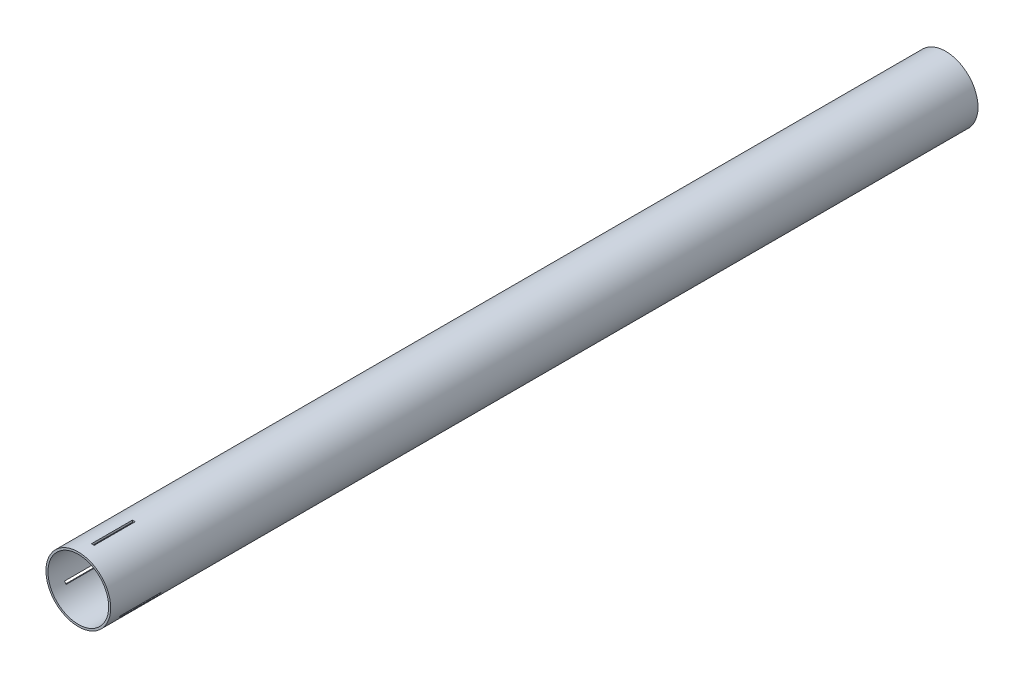
ISO-10303-21;
HEADER;
FILE_DESCRIPTION(('STEP AP214'),'2;1');
FILE_NAME('part.step','',(''),(''),'','','');
FILE_SCHEMA(('AUTOMOTIVE_DESIGN { 1 0 10303 214 1 1 1 1 }'));
ENDSEC;
DATA;
#1=APPLICATION_CONTEXT('core data for automotive mechanical design processes');
#2=APPLICATION_PROTOCOL_DEFINITION('international standard','automotive_design',2000,#1);
#3=PRODUCT_CONTEXT('',#1,'mechanical');
#4=PRODUCT('Part','Part','',(#3));
#5=PRODUCT_RELATED_PRODUCT_CATEGORY('part','',(#4));
#6=PRODUCT_DEFINITION_FORMATION('','',#4);
#7=PRODUCT_DEFINITION_CONTEXT('part definition',#1,'design');
#8=PRODUCT_DEFINITION('design','',#6,#7);
#9=PRODUCT_DEFINITION_SHAPE('','',#8);
#10=(LENGTH_UNIT() NAMED_UNIT(*) SI_UNIT(.MILLI.,.METRE.));
#11=(NAMED_UNIT(*) PLANE_ANGLE_UNIT() SI_UNIT($,.RADIAN.));
#12=(NAMED_UNIT(*) SI_UNIT($,.STERADIAN.) SOLID_ANGLE_UNIT());
#13=UNCERTAINTY_MEASURE_WITH_UNIT(LENGTH_MEASURE(1.E-05),#10,'distance_accuracy_value','');
#14=(GEOMETRIC_REPRESENTATION_CONTEXT(3) GLOBAL_UNCERTAINTY_ASSIGNED_CONTEXT((#13)) GLOBAL_UNIT_ASSIGNED_CONTEXT((#10,
#11,#12)) REPRESENTATION_CONTEXT('',''));
#15=CARTESIAN_POINT('',(0.,0.,0.));
#16=DIRECTION('',(0.,0.,1.));
#17=DIRECTION('',(1.,0.,0.));
#18=AXIS2_PLACEMENT_3D('',#15,#16,#17);
#19=CARTESIAN_POINT('',(0.,0.,635.));
#20=DIRECTION('',(0.,0.,1.));
#21=DIRECTION('',(1.,0.,0.));
#22=AXIS2_PLACEMENT_3D('',#19,#20,#21);
#23=PLANE('',#22);
#24=CARTESIAN_POINT('',(0.,0.,635.));
#25=DIRECTION('',(0.,0.,1.));
#26=DIRECTION('',(1.,0.,0.));
#27=AXIS2_PLACEMENT_3D('',#24,#25,#26);
#28=CIRCLE('',#27,23.6982);
#29=CARTESIAN_POINT('',(23.6982,0.,635.));
#30=VERTEX_POINT('',#29);
#31=EDGE_CURVE('E13',#30,#30,#28,.T.);
#32=ORIENTED_EDGE('',*,*,#31,.T.);
#33=EDGE_LOOP('',(#32));
#34=FACE_BOUND('',#33,.T.);
#35=CARTESIAN_POINT('',(0.,0.,635.));
#36=DIRECTION('',(0.,0.,1.));
#37=DIRECTION('',(1.,0.,0.));
#38=AXIS2_PLACEMENT_3D('',#35,#36,#37);
#39=CIRCLE('',#38,22.225);
#40=CARTESIAN_POINT('',(22.225,0.,635.));
#41=VERTEX_POINT('',#40);
#42=EDGE_CURVE('E236',#41,#41,#39,.T.);
#43=ORIENTED_EDGE('',*,*,#42,.F.);
#44=EDGE_LOOP('',(#43));
#45=FACE_BOUND('',#44,.T.);
#46=ADVANCED_FACE('F44',(#34,#45),#23,.T.);
#47=CARTESIAN_POINT('',(0.,0.,0.));
#48=DIRECTION('',(0.,0.,1.));
#49=DIRECTION('',(1.,0.,0.));
#50=AXIS2_PLACEMENT_3D('',#47,#48,#49);
#51=PLANE('',#50);
#52=CARTESIAN_POINT('',(0.,0.,0.));
#53=DIRECTION('',(0.,0.,1.));
#54=DIRECTION('',(1.,0.,0.));
#55=AXIS2_PLACEMENT_3D('',#52,#53,#54);
#56=CIRCLE('',#55,23.6982);
#57=CARTESIAN_POINT('',(23.6982,0.,0.));
#58=VERTEX_POINT('',#57);
#59=EDGE_CURVE('E48',#58,#58,#56,.T.);
#60=ORIENTED_EDGE('',*,*,#59,.F.);
#61=EDGE_LOOP('',(#60));
#62=FACE_BOUND('',#61,.T.);
#63=CARTESIAN_POINT('',(0.,0.,0.));
#64=DIRECTION('',(0.,0.,1.));
#65=DIRECTION('',(1.,0.,0.));
#66=AXIS2_PLACEMENT_3D('',#63,#64,#65);
#67=CIRCLE('',#66,22.225);
#68=CARTESIAN_POINT('',(22.225,0.,0.));
#69=VERTEX_POINT('',#68);
#70=EDGE_CURVE('E235',#69,#69,#67,.T.);
#71=ORIENTED_EDGE('',*,*,#70,.T.);
#72=EDGE_LOOP('',(#71));
#73=FACE_BOUND('',#72,.T.);
#74=ADVANCED_FACE('F242',(#62,#73),#51,.F.);
#75=CARTESIAN_POINT('',(0.,0.,635.));
#76=DIRECTION('',(0.,0.,-1.));
#77=DIRECTION('',(-1.,0.,0.));
#78=AXIS2_PLACEMENT_3D('',#75,#76,#77);
#79=CYLINDRICAL_SURFACE('',#78,23.6982);
#80=CARTESIAN_POINT('',(0.,0.,595.));
#81=DIRECTION('',(0.,0.,-1.));
#82=DIRECTION('',(-1.,0.,0.));
#83=AXIS2_PLACEMENT_3D('',#80,#81,#82);
#84=CIRCLE('',#83,23.6982);
#85=CARTESIAN_POINT('',(-21.2708932392924,-10.4476688329323,595.));
#86=VERTEX_POINT('',#85);
#87=CARTESIAN_POINT('',(-20.3138838992341,-12.2045403095912,595.));
#88=VERTEX_POINT('',#87);
#89=EDGE_CURVE('E149',#86,#88,#84,.F.);
#90=ORIENTED_EDGE('',*,*,#89,.F.);
#91=DIRECTION('',(0.,0.,-1.));
#92=VECTOR('',#91,1.);
#93=CARTESIAN_POINT('',(-21.2708932392924,-10.4476688329323,635.));
#94=LINE('',#93,#92);
#95=CARTESIAN_POINT('',(-21.2708932392924,-10.4476688329323,625.));
#96=VERTEX_POINT('',#95);
#97=EDGE_CURVE('E174',#96,#86,#94,.T.);
#98=ORIENTED_EDGE('',*,*,#97,.F.);
#99=CARTESIAN_POINT('',(0.,0.,625.));
#100=DIRECTION('',(0.,0.,1.));
#101=DIRECTION('',(1.,0.,0.));
#102=AXIS2_PLACEMENT_3D('',#99,#100,#101);
#103=CIRCLE('',#102,23.6982);
#104=CARTESIAN_POINT('',(-20.3138838992341,-12.2045403095912,625.));
#105=VERTEX_POINT('',#104);
#106=EDGE_CURVE('E166',#105,#96,#103,.F.);
#107=ORIENTED_EDGE('',*,*,#106,.F.);
#108=DIRECTION('',(0.,0.,-1.));
#109=VECTOR('',#108,1.);
#110=CARTESIAN_POINT('',(-20.3138838992341,-12.2045403095912,635.));
#111=LINE('',#110,#109);
#112=EDGE_CURVE('E59',#88,#105,#111,.F.);
#113=ORIENTED_EDGE('',*,*,#112,.F.);
#114=EDGE_LOOP('',(#90,#98,#107,#113));
#115=FACE_BOUND('',#114,.T.);
#116=CARTESIAN_POINT('',(0.,0.,595.));
#117=DIRECTION('',(0.,0.,-1.));
#118=DIRECTION('',(-1.,0.,0.));
#119=AXIS2_PLACEMENT_3D('',#116,#117,#118);
#120=CIRCLE('',#119,23.6982);
#121=CARTESIAN_POINT('',(19.6833932392926,-13.1972994899476,595.));
#122=VERTEX_POINT('',#121);
#123=CARTESIAN_POINT('',(20.7263838992343,-11.4900693514688,595.));
#124=VERTEX_POINT('',#123);
#125=EDGE_CURVE('E187',#122,#124,#120,.F.);
#126=ORIENTED_EDGE('',*,*,#125,.F.);
#127=DIRECTION('',(0.,0.,-1.));
#128=VECTOR('',#127,1.);
#129=CARTESIAN_POINT('',(19.6833932392926,-13.1972994899476,635.));
#130=LINE('',#129,#128);
#131=CARTESIAN_POINT('',(19.6833932392926,-13.1972994899476,625.));
#132=VERTEX_POINT('',#131);
#133=EDGE_CURVE('E157',#132,#122,#130,.T.);
#134=ORIENTED_EDGE('',*,*,#133,.F.);
#135=CARTESIAN_POINT('',(0.,0.,625.));
#136=DIRECTION('',(0.,0.,1.));
#137=DIRECTION('',(1.,0.,0.));
#138=AXIS2_PLACEMENT_3D('',#135,#136,#137);
#139=CIRCLE('',#138,23.6982);
#140=CARTESIAN_POINT('',(20.7263838992343,-11.4900693514688,625.));
#141=VERTEX_POINT('',#140);
#142=EDGE_CURVE('E191',#141,#132,#139,.F.);
#143=ORIENTED_EDGE('',*,*,#142,.F.);
#144=DIRECTION('',(0.,0.,-1.));
#145=VECTOR('',#144,1.);
#146=CARTESIAN_POINT('',(20.7263838992343,-11.4900693514688,635.));
#147=LINE('',#146,#145);
#148=EDGE_CURVE('E67',#124,#141,#147,.F.);
#149=ORIENTED_EDGE('',*,*,#148,.F.);
#150=EDGE_LOOP('',(#126,#134,#143,#149));
#151=FACE_BOUND('',#150,.T.);
#152=CARTESIAN_POINT('',(0.,0.,595.));
#153=DIRECTION('',(0.,0.,-1.));
#154=DIRECTION('',(-1.,0.,0.));
#155=AXIS2_PLACEMENT_3D('',#152,#153,#154);
#156=CIRCLE('',#155,23.6982);
#157=CARTESIAN_POINT('',(1.5875,23.64496832288,595.));
#158=VERTEX_POINT('',#157);
#159=CARTESIAN_POINT('',(-0.4125,23.69460966106,595.));
#160=VERTEX_POINT('',#159);
#161=EDGE_CURVE('E212',#158,#160,#156,.F.);
#162=ORIENTED_EDGE('',*,*,#161,.F.);
#163=DIRECTION('',(0.,0.,-1.));
#164=VECTOR('',#163,1.);
#165=CARTESIAN_POINT('',(1.5875,23.64496832288,635.));
#166=LINE('',#165,#164);
#167=CARTESIAN_POINT('',(1.5875,23.64496832288,625.));
#168=VERTEX_POINT('',#167);
#169=EDGE_CURVE('E232',#168,#158,#166,.T.);
#170=ORIENTED_EDGE('',*,*,#169,.F.);
#171=CARTESIAN_POINT('',(0.,0.,625.));
#172=DIRECTION('',(0.,0.,1.));
#173=DIRECTION('',(1.,0.,0.));
#174=AXIS2_PLACEMENT_3D('',#171,#172,#173);
#175=CIRCLE('',#174,23.6982);
#176=CARTESIAN_POINT('',(-0.4125,23.69460966106,625.));
#177=VERTEX_POINT('',#176);
#178=EDGE_CURVE('E217',#177,#168,#175,.F.);
#179=ORIENTED_EDGE('',*,*,#178,.F.);
#180=DIRECTION('',(0.,0.,-1.));
#181=VECTOR('',#180,1.);
#182=CARTESIAN_POINT('',(-0.4125,23.69460966106,635.));
#183=LINE('',#182,#181);
#184=EDGE_CURVE('E215',#160,#177,#183,.F.);
#185=ORIENTED_EDGE('',*,*,#184,.F.);
#186=EDGE_LOOP('',(#162,#170,#179,#185));
#187=FACE_BOUND('',#186,.T.);
#188=ORIENTED_EDGE('',*,*,#31,.F.);
#189=EDGE_LOOP('',(#188));
#190=FACE_BOUND('',#189,.T.);
#191=ORIENTED_EDGE('',*,*,#59,.T.);
#192=EDGE_LOOP('',(#191));
#193=FACE_BOUND('',#192,.T.);
#194=ADVANCED_FACE('F46',(#115,#151,#187,#190,#193),#79,.T.);
#195=CARTESIAN_POINT('',(0.,0.,635.));
#196=DIRECTION('',(0.,0.,-1.));
#197=DIRECTION('',(-1.,0.,0.));
#198=AXIS2_PLACEMENT_3D('',#195,#196,#197);
#199=CYLINDRICAL_SURFACE('',#198,22.225);
#200=DIRECTION('',(0.,0.,-1.));
#201=VECTOR('',#200,1.);
#202=CARTESIAN_POINT('',(-19.9920012631359,-9.70930020623389,635.));
#203=LINE('',#202,#201);
#204=CARTESIAN_POINT('',(-19.9920012631359,-9.70930020623389,625.));
#205=VERTEX_POINT('',#204);
#206=CARTESIAN_POINT('',(-19.9920012631359,-9.70930020623389,595.));
#207=VERTEX_POINT('',#206);
#208=EDGE_CURVE('E156',#205,#207,#203,.T.);
#209=ORIENTED_EDGE('',*,*,#208,.T.);
#210=CARTESIAN_POINT('',(0.,0.,595.));
#211=DIRECTION('',(0.,0.,-1.));
#212=DIRECTION('',(-1.,0.,0.));
#213=AXIS2_PLACEMENT_3D('',#210,#211,#212);
#214=CIRCLE('',#213,22.225);
#215=CARTESIAN_POINT('',(-19.0378491361637,-11.4678212956372,595.));
#216=VERTEX_POINT('',#215);
#217=EDGE_CURVE('E143',#207,#216,#214,.F.);
#218=ORIENTED_EDGE('',*,*,#217,.T.);
#219=DIRECTION('',(0.,0.,-1.));
#220=VECTOR('',#219,1.);
#221=CARTESIAN_POINT('',(-19.0378491361637,-11.4678212956372,635.));
#222=LINE('',#221,#220);
#223=CARTESIAN_POINT('',(-19.0378491361637,-11.4678212956372,625.));
#224=VERTEX_POINT('',#223);
#225=EDGE_CURVE('E133',#216,#224,#222,.F.);
#226=ORIENTED_EDGE('',*,*,#225,.T.);
#227=CARTESIAN_POINT('',(0.,0.,625.));
#228=DIRECTION('',(0.,0.,1.));
#229=DIRECTION('',(1.,0.,0.));
#230=AXIS2_PLACEMENT_3D('',#227,#228,#229);
#231=CIRCLE('',#230,22.225);
#232=EDGE_CURVE('E142',#224,#205,#231,.F.);
#233=ORIENTED_EDGE('',*,*,#232,.T.);
#234=EDGE_LOOP('',(#209,#218,#226,#233));
#235=FACE_BOUND('',#234,.T.);
#236=DIRECTION('',(0.,0.,-1.));
#237=VECTOR('',#236,1.);
#238=CARTESIAN_POINT('',(18.404501263136,-12.4589308632492,635.));
#239=LINE('',#238,#237);
#240=CARTESIAN_POINT('',(18.404501263136,-12.4589308632492,625.));
#241=VERTEX_POINT('',#240);
#242=CARTESIAN_POINT('',(18.404501263136,-12.4589308632492,595.));
#243=VERTEX_POINT('',#242);
#244=EDGE_CURVE('E160',#241,#243,#239,.T.);
#245=ORIENTED_EDGE('',*,*,#244,.T.);
#246=CARTESIAN_POINT('',(0.,0.,595.));
#247=DIRECTION('',(0.,0.,-1.));
#248=DIRECTION('',(-1.,0.,0.));
#249=AXIS2_PLACEMENT_3D('',#246,#247,#248);
#250=CIRCLE('',#249,22.225);
#251=CARTESIAN_POINT('',(19.4503491361639,-10.7533503375147,595.));
#252=VERTEX_POINT('',#251);
#253=EDGE_CURVE('E178',#243,#252,#250,.F.);
#254=ORIENTED_EDGE('',*,*,#253,.T.);
#255=DIRECTION('',(0.,0.,-1.));
#256=VECTOR('',#255,1.);
#257=CARTESIAN_POINT('',(19.4503491361639,-10.7533503375147,635.));
#258=LINE('',#257,#256);
#259=CARTESIAN_POINT('',(19.4503491361639,-10.7533503375147,625.));
#260=VERTEX_POINT('',#259);
#261=EDGE_CURVE('E181',#252,#260,#258,.F.);
#262=ORIENTED_EDGE('',*,*,#261,.T.);
#263=CARTESIAN_POINT('',(0.,0.,625.));
#264=DIRECTION('',(0.,0.,1.));
#265=DIRECTION('',(1.,0.,0.));
#266=AXIS2_PLACEMENT_3D('',#263,#264,#265);
#267=CIRCLE('',#266,22.225);
#268=EDGE_CURVE('E184',#260,#241,#267,.F.);
#269=ORIENTED_EDGE('',*,*,#268,.T.);
#270=EDGE_LOOP('',(#245,#254,#262,#269));
#271=FACE_BOUND('',#270,.T.);
#272=DIRECTION('',(0.,0.,-1.));
#273=VECTOR('',#272,1.);
#274=CARTESIAN_POINT('',(1.5875,22.1682310694832,635.));
#275=LINE('',#274,#273);
#276=CARTESIAN_POINT('',(1.5875,22.1682310694832,625.));
#277=VERTEX_POINT('',#276);
#278=CARTESIAN_POINT('',(1.5875,22.1682310694832,595.));
#279=VERTEX_POINT('',#278);
#280=EDGE_CURVE('E224',#277,#279,#275,.T.);
#281=ORIENTED_EDGE('',*,*,#280,.T.);
#282=CARTESIAN_POINT('',(0.,0.,595.));
#283=DIRECTION('',(0.,0.,-1.));
#284=DIRECTION('',(-1.,0.,0.));
#285=AXIS2_PLACEMENT_3D('',#282,#283,#284);
#286=CIRCLE('',#285,22.225);
#287=CARTESIAN_POINT('',(-0.4125,22.221171633152,595.));
#288=VERTEX_POINT('',#287);
#289=EDGE_CURVE('E177',#279,#288,#286,.F.);
#290=ORIENTED_EDGE('',*,*,#289,.T.);
#291=DIRECTION('',(0.,0.,-1.));
#292=VECTOR('',#291,1.);
#293=CARTESIAN_POINT('',(-0.4125,22.221171633152,635.));
#294=LINE('',#293,#292);
#295=CARTESIAN_POINT('',(-0.4125,22.221171633152,625.));
#296=VERTEX_POINT('',#295);
#297=EDGE_CURVE('E206',#288,#296,#294,.F.);
#298=ORIENTED_EDGE('',*,*,#297,.T.);
#299=CARTESIAN_POINT('',(0.,0.,625.));
#300=DIRECTION('',(0.,0.,1.));
#301=DIRECTION('',(1.,0.,0.));
#302=AXIS2_PLACEMENT_3D('',#299,#300,#301);
#303=CIRCLE('',#302,22.225);
#304=EDGE_CURVE('E209',#296,#277,#303,.F.);
#305=ORIENTED_EDGE('',*,*,#304,.T.);
#306=EDGE_LOOP('',(#281,#290,#298,#305));
#307=FACE_BOUND('',#306,.T.);
#308=ORIENTED_EDGE('',*,*,#42,.T.);
#309=EDGE_LOOP('',(#308));
#310=FACE_BOUND('',#309,.T.);
#311=ORIENTED_EDGE('',*,*,#70,.F.);
#312=EDGE_LOOP('',(#311));
#313=FACE_BOUND('',#312,.T.);
#314=ADVANCED_FACE('F153',(#235,#271,#307,#310,#313),#199,.F.);
#315=CARTESIAN_POINT('',(1.5875,-23.6992,625.));
#316=DIRECTION('',(1.,0.,0.));
#317=DIRECTION('',(0.,0.,-1.));
#318=AXIS2_PLACEMENT_3D('',#315,#316,#317);
#319=PLANE('',#318);
#320=ORIENTED_EDGE('',*,*,#169,.T.);
#321=DIRECTION('',(0.,1.,0.));
#322=VECTOR('',#321,1.);
#323=CARTESIAN_POINT('',(1.5875,-23.6992,595.));
#324=LINE('',#323,#322);
#325=EDGE_CURVE('E227',#279,#158,#324,.T.);
#326=ORIENTED_EDGE('',*,*,#325,.F.);
#327=ORIENTED_EDGE('',*,*,#280,.F.);
#328=DIRECTION('',(0.,1.,0.));
#329=VECTOR('',#328,1.);
#330=CARTESIAN_POINT('',(1.5875,-23.6992,625.));
#331=LINE('',#330,#329);
#332=EDGE_CURVE('E220',#277,#168,#331,.T.);
#333=ORIENTED_EDGE('',*,*,#332,.T.);
#334=EDGE_LOOP('',(#320,#326,#327,#333));
#335=FACE_BOUND('',#334,.T.);
#336=ADVANCED_FACE('F245',(#335),#319,.F.);
#337=CARTESIAN_POINT('',(-0.4125,-23.6992,595.));
#338=DIRECTION('',(0.,0.,-1.));
#339=DIRECTION('',(-1.,0.,0.));
#340=AXIS2_PLACEMENT_3D('',#337,#338,#339);
#341=PLANE('',#340);
#342=ORIENTED_EDGE('',*,*,#161,.T.);
#343=DIRECTION('',(0.,1.,0.));
#344=VECTOR('',#343,1.);
#345=CARTESIAN_POINT('',(-0.4125,-23.6992,595.));
#346=LINE('',#345,#344);
#347=EDGE_CURVE('E225',#288,#160,#346,.T.);
#348=ORIENTED_EDGE('',*,*,#347,.F.);
#349=ORIENTED_EDGE('',*,*,#289,.F.);
#350=ORIENTED_EDGE('',*,*,#325,.T.);
#351=EDGE_LOOP('',(#342,#348,#349,#350));
#352=FACE_BOUND('',#351,.T.);
#353=ADVANCED_FACE('F252',(#352),#341,.F.);
#354=CARTESIAN_POINT('',(-0.4125,-23.6992,625.));
#355=DIRECTION('',(-1.,0.,0.));
#356=DIRECTION('',(0.,0.,1.));
#357=AXIS2_PLACEMENT_3D('',#354,#355,#356);
#358=PLANE('',#357);
#359=ORIENTED_EDGE('',*,*,#184,.T.);
#360=DIRECTION('',(0.,1.,0.));
#361=VECTOR('',#360,1.);
#362=CARTESIAN_POINT('',(-0.4125,-23.6992,625.));
#363=LINE('',#362,#361);
#364=EDGE_CURVE('E221',#296,#177,#363,.T.);
#365=ORIENTED_EDGE('',*,*,#364,.F.);
#366=ORIENTED_EDGE('',*,*,#297,.F.);
#367=ORIENTED_EDGE('',*,*,#347,.T.);
#368=EDGE_LOOP('',(#359,#365,#366,#367));
#369=FACE_BOUND('',#368,.T.);
#370=ADVANCED_FACE('F295',(#369),#358,.F.);
#371=CARTESIAN_POINT('',(-0.4125,-23.6992,625.));
#372=DIRECTION('',(0.,0.,1.));
#373=DIRECTION('',(1.,0.,0.));
#374=AXIS2_PLACEMENT_3D('',#371,#372,#373);
#375=PLANE('',#374);
#376=ORIENTED_EDGE('',*,*,#178,.T.);
#377=ORIENTED_EDGE('',*,*,#332,.F.);
#378=ORIENTED_EDGE('',*,*,#304,.F.);
#379=ORIENTED_EDGE('',*,*,#364,.T.);
#380=EDGE_LOOP('',(#376,#377,#378,#379));
#381=FACE_BOUND('',#380,.T.);
#382=ADVANCED_FACE('F303',(#381),#375,.F.);
#383=CARTESIAN_POINT('',(-28.8302046246841,14.812039296176,625.));
#384=DIRECTION('',(-0.499999999999992,-0.866025403784443,0.));
#385=DIRECTION('',(0.866025403784443,-0.499999999999992,0.));
#386=AXIS2_PLACEMENT_3D('',#383,#384,#385);
#387=PLANE('',#386);
#388=ORIENTED_EDGE('',*,*,#133,.T.);
#389=DIRECTION('',(0.866025403784443,-0.499999999999992,0.));
#390=VECTOR('',#389,1.);
#391=CARTESIAN_POINT('',(-28.8302046246841,14.812039296176,595.));
#392=LINE('',#391,#390);
#393=EDGE_CURVE('E199',#243,#122,#392,.T.);
#394=ORIENTED_EDGE('',*,*,#393,.F.);
#395=ORIENTED_EDGE('',*,*,#244,.F.);
#396=DIRECTION('',(0.866025403784443,-0.499999999999992,0.));
#397=VECTOR('',#396,1.);
#398=CARTESIAN_POINT('',(-28.8302046246841,14.812039296176,625.));
#399=LINE('',#398,#397);
#400=EDGE_CURVE('E194',#241,#132,#399,.T.);
#401=ORIENTED_EDGE('',*,*,#400,.T.);
#402=EDGE_LOOP('',(#388,#394,#395,#401));
#403=FACE_BOUND('',#402,.T.);
#404=ADVANCED_FACE('F310',(#403),#387,.F.);
#405=CARTESIAN_POINT('',(-27.8302046246842,16.5440901037449,595.));
#406=DIRECTION('',(0.,0.,-1.));
#407=DIRECTION('',(-1.,0.,0.));
#408=AXIS2_PLACEMENT_3D('',#405,#406,#407);
#409=PLANE('',#408);
#410=ORIENTED_EDGE('',*,*,#125,.T.);
#411=DIRECTION('',(0.866025403784443,-0.499999999999992,0.));
#412=VECTOR('',#411,1.);
#413=CARTESIAN_POINT('',(-27.8302046246842,16.5440901037449,595.));
#414=LINE('',#413,#412);
#415=EDGE_CURVE('E197',#252,#124,#414,.T.);
#416=ORIENTED_EDGE('',*,*,#415,.F.);
#417=ORIENTED_EDGE('',*,*,#253,.F.);
#418=ORIENTED_EDGE('',*,*,#393,.T.);
#419=EDGE_LOOP('',(#410,#416,#417,#418));
#420=FACE_BOUND('',#419,.T.);
#421=ADVANCED_FACE('F316',(#420),#409,.F.);
#422=CARTESIAN_POINT('',(-27.8302046246842,16.5440901037449,625.));
#423=DIRECTION('',(0.499999999999992,0.866025403784443,0.));
#424=DIRECTION('',(-0.866025403784443,0.499999999999992,0.));
#425=AXIS2_PLACEMENT_3D('',#422,#423,#424);
#426=PLANE('',#425);
#427=ORIENTED_EDGE('',*,*,#148,.T.);
#428=DIRECTION('',(0.866025403784443,-0.499999999999992,0.));
#429=VECTOR('',#428,1.);
#430=CARTESIAN_POINT('',(-27.8302046246842,16.5440901037449,625.));
#431=LINE('',#430,#429);
#432=EDGE_CURVE('E195',#260,#141,#431,.T.);
#433=ORIENTED_EDGE('',*,*,#432,.F.);
#434=ORIENTED_EDGE('',*,*,#261,.F.);
#435=ORIENTED_EDGE('',*,*,#415,.T.);
#436=EDGE_LOOP('',(#427,#433,#434,#435));
#437=FACE_BOUND('',#436,.T.);
#438=ADVANCED_FACE('F324',(#437),#426,.F.);
#439=CARTESIAN_POINT('',(-27.8302046246842,16.5440901037449,625.));
#440=DIRECTION('',(0.,0.,1.));
#441=DIRECTION('',(1.,0.,0.));
#442=AXIS2_PLACEMENT_3D('',#439,#440,#441);
#443=PLANE('',#442);
#444=ORIENTED_EDGE('',*,*,#142,.T.);
#445=ORIENTED_EDGE('',*,*,#400,.F.);
#446=ORIENTED_EDGE('',*,*,#268,.F.);
#447=ORIENTED_EDGE('',*,*,#432,.T.);
#448=EDGE_LOOP('',(#444,#445,#446,#447));
#449=FACE_BOUND('',#448,.T.);
#450=ADVANCED_FACE('F332',(#449),#443,.F.);
#451=CARTESIAN_POINT('',(27.242704624684,17.561669953192,625.));
#452=DIRECTION('',(-0.500000000000004,0.866025403784436,0.));
#453=DIRECTION('',(-0.866025403784436,-0.500000000000004,0.));
#454=AXIS2_PLACEMENT_3D('',#451,#452,#453);
#455=PLANE('',#454);
#456=ORIENTED_EDGE('',*,*,#97,.T.);
#457=DIRECTION('',(-0.866025403784436,-0.500000000000004,0.));
#458=VECTOR('',#457,1.);
#459=CARTESIAN_POINT('',(27.242704624684,17.561669953192,595.));
#460=LINE('',#459,#458);
#461=EDGE_CURVE('E150',#207,#86,#460,.T.);
#462=ORIENTED_EDGE('',*,*,#461,.F.);
#463=ORIENTED_EDGE('',*,*,#208,.F.);
#464=DIRECTION('',(-0.866025403784436,-0.500000000000004,0.));
#465=VECTOR('',#464,1.);
#466=CARTESIAN_POINT('',(27.242704624684,17.561669953192,625.));
#467=LINE('',#466,#465);
#468=EDGE_CURVE('E169',#205,#96,#467,.T.);
#469=ORIENTED_EDGE('',*,*,#468,.T.);
#470=EDGE_LOOP('',(#456,#462,#463,#469));
#471=FACE_BOUND('',#470,.T.);
#472=ADVANCED_FACE('F339',(#471),#455,.F.);
#473=CARTESIAN_POINT('',(28.242704624684,15.8296191456231,595.));
#474=DIRECTION('',(0.,0.,-1.));
#475=DIRECTION('',(-1.,0.,0.));
#476=AXIS2_PLACEMENT_3D('',#473,#474,#475);
#477=PLANE('',#476);
#478=ORIENTED_EDGE('',*,*,#89,.T.);
#479=DIRECTION('',(-0.866025403784436,-0.500000000000004,0.));
#480=VECTOR('',#479,1.);
#481=CARTESIAN_POINT('',(28.242704624684,15.8296191456231,595.));
#482=LINE('',#481,#480);
#483=EDGE_CURVE('E136',#216,#88,#482,.T.);
#484=ORIENTED_EDGE('',*,*,#483,.F.);
#485=ORIENTED_EDGE('',*,*,#217,.F.);
#486=ORIENTED_EDGE('',*,*,#461,.T.);
#487=EDGE_LOOP('',(#478,#484,#485,#486));
#488=FACE_BOUND('',#487,.T.);
#489=ADVANCED_FACE('F146',(#488),#477,.F.);
#490=CARTESIAN_POINT('',(28.242704624684,15.8296191456231,625.));
#491=DIRECTION('',(0.500000000000004,-0.866025403784436,0.));
#492=DIRECTION('',(0.866025403784436,0.500000000000004,0.));
#493=AXIS2_PLACEMENT_3D('',#490,#491,#492);
#494=PLANE('',#493);
#495=ORIENTED_EDGE('',*,*,#112,.T.);
#496=DIRECTION('',(-0.866025403784436,-0.500000000000004,0.));
#497=VECTOR('',#496,1.);
#498=CARTESIAN_POINT('',(28.242704624684,15.8296191456231,625.));
#499=LINE('',#498,#497);
#500=EDGE_CURVE('E138',#224,#105,#499,.T.);
#501=ORIENTED_EDGE('',*,*,#500,.F.);
#502=ORIENTED_EDGE('',*,*,#225,.F.);
#503=ORIENTED_EDGE('',*,*,#483,.T.);
#504=EDGE_LOOP('',(#495,#501,#502,#503));
#505=FACE_BOUND('',#504,.T.);
#506=ADVANCED_FACE('F135',(#505),#494,.F.);
#507=CARTESIAN_POINT('',(28.242704624684,15.8296191456231,625.));
#508=DIRECTION('',(0.,0.,1.));
#509=DIRECTION('',(1.,0.,0.));
#510=AXIS2_PLACEMENT_3D('',#507,#508,#509);
#511=PLANE('',#510);
#512=ORIENTED_EDGE('',*,*,#106,.T.);
#513=ORIENTED_EDGE('',*,*,#468,.F.);
#514=ORIENTED_EDGE('',*,*,#232,.F.);
#515=ORIENTED_EDGE('',*,*,#500,.T.);
#516=EDGE_LOOP('',(#512,#513,#514,#515));
#517=FACE_BOUND('',#516,.T.);
#518=ADVANCED_FACE('F360',(#517),#511,.F.);
#519=CLOSED_SHELL('',(#46,#74,#194,#314,#336,#353,#370,#382,#404,#421,#438,#450,#472,#489,#506,#518));
#520=MANIFOLD_SOLID_BREP('B2',#519);
#521=ADVANCED_BREP_SHAPE_REPRESENTATION('',(#18,#520),#14);
#522=SHAPE_DEFINITION_REPRESENTATION(#9,#521);
ENDSEC;
END-ISO-10303-21;
